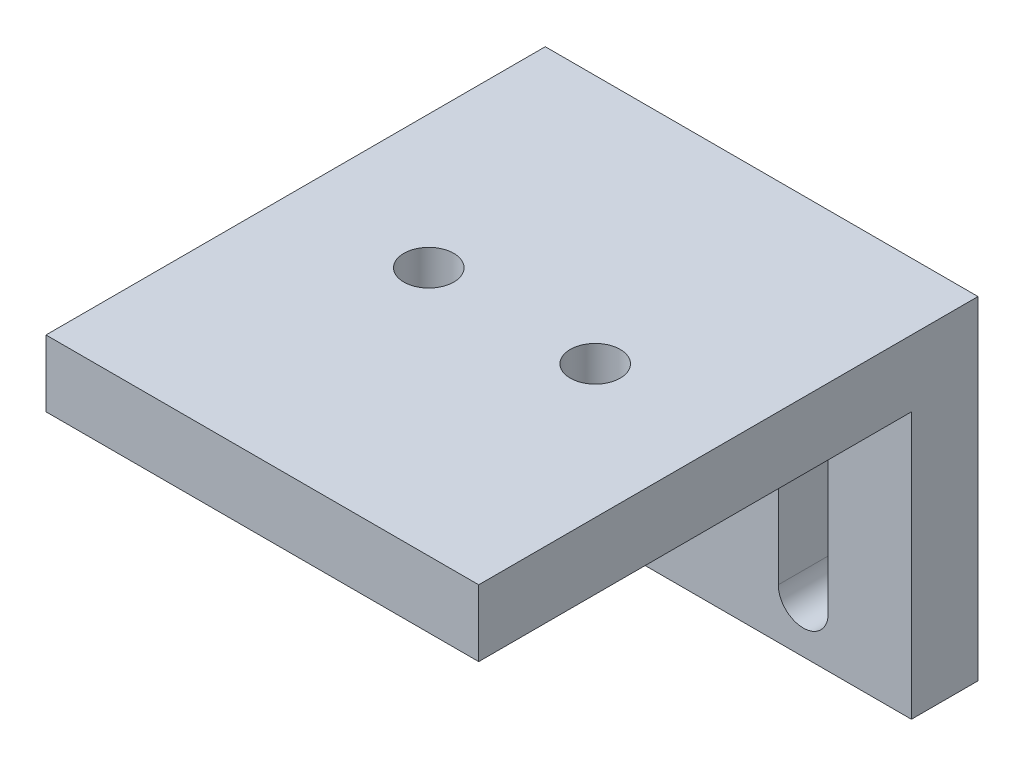
ISO-10303-21;
HEADER;
FILE_DESCRIPTION(('STEP AP214'),'2;1');
FILE_NAME('part.step','',(''),(''),'','','');
FILE_SCHEMA(('AUTOMOTIVE_DESIGN { 1 0 10303 214 1 1 1 1 }'));
ENDSEC;
DATA;
#1=APPLICATION_CONTEXT('core data for automotive mechanical design processes');
#2=APPLICATION_PROTOCOL_DEFINITION('international standard','automotive_design',2000,#1);
#3=PRODUCT_CONTEXT('',#1,'mechanical');
#4=PRODUCT('Part','Part','',(#3));
#5=PRODUCT_RELATED_PRODUCT_CATEGORY('part','',(#4));
#6=PRODUCT_DEFINITION_FORMATION('','',#4);
#7=PRODUCT_DEFINITION_CONTEXT('part definition',#1,'design');
#8=PRODUCT_DEFINITION('design','',#6,#7);
#9=PRODUCT_DEFINITION_SHAPE('','',#8);
#10=(LENGTH_UNIT() NAMED_UNIT(*) SI_UNIT(.MILLI.,.METRE.));
#11=(NAMED_UNIT(*) PLANE_ANGLE_UNIT() SI_UNIT($,.RADIAN.));
#12=(NAMED_UNIT(*) SI_UNIT($,.STERADIAN.) SOLID_ANGLE_UNIT());
#13=UNCERTAINTY_MEASURE_WITH_UNIT(LENGTH_MEASURE(1.E-05),#10,'distance_accuracy_value','');
#14=(GEOMETRIC_REPRESENTATION_CONTEXT(3) GLOBAL_UNCERTAINTY_ASSIGNED_CONTEXT((#13)) GLOBAL_UNIT_ASSIGNED_CONTEXT((#10,
#11,#12)) REPRESENTATION_CONTEXT('',''));
#15=CARTESIAN_POINT('',(0.,0.,0.));
#16=DIRECTION('',(0.,0.,1.));
#17=DIRECTION('',(1.,0.,0.));
#18=AXIS2_PLACEMENT_3D('',#15,#16,#17);
#19=CARTESIAN_POINT('',(-13.,20.,2.));
#20=DIRECTION('',(0.,0.,-1.));
#21=DIRECTION('',(-1.,0.,0.));
#22=AXIS2_PLACEMENT_3D('',#19,#20,#21);
#23=PLANE('',#22);
#24=DIRECTION('',(0.,1.,0.));
#25=VECTOR('',#24,1.);
#26=CARTESIAN_POINT('',(-5.,13.,2.));
#27=LINE('',#26,#25);
#28=CARTESIAN_POINT('',(-5.,3.,2.));
#29=VERTEX_POINT('',#28);
#30=CARTESIAN_POINT('',(-5.,13.,2.));
#31=VERTEX_POINT('',#30);
#32=EDGE_CURVE('E154',#29,#31,#27,.T.);
#33=ORIENTED_EDGE('',*,*,#32,.F.);
#34=CARTESIAN_POINT('',(-6.5,3.,2.));
#35=DIRECTION('',(0.,0.,1.));
#36=DIRECTION('',(-1.,0.,0.));
#37=AXIS2_PLACEMENT_3D('',#34,#35,#36);
#38=CIRCLE('',#37,1.5);
#39=CARTESIAN_POINT('',(-8.,3.,2.));
#40=VERTEX_POINT('',#39);
#41=EDGE_CURVE('E51',#40,#29,#38,.T.);
#42=ORIENTED_EDGE('',*,*,#41,.F.);
#43=DIRECTION('',(0.,-1.,0.));
#44=VECTOR('',#43,1.);
#45=CARTESIAN_POINT('',(-8.,13.,2.));
#46=LINE('',#45,#44);
#47=CARTESIAN_POINT('',(-8.,13.,2.));
#48=VERTEX_POINT('',#47);
#49=EDGE_CURVE('E160',#48,#40,#46,.T.);
#50=ORIENTED_EDGE('',*,*,#49,.F.);
#51=CARTESIAN_POINT('',(-6.5,13.,2.));
#52=DIRECTION('',(0.,0.,1.));
#53=DIRECTION('',(1.,0.,0.));
#54=AXIS2_PLACEMENT_3D('',#51,#52,#53);
#55=CIRCLE('',#54,1.5);
#56=EDGE_CURVE('E144',#31,#48,#55,.T.);
#57=ORIENTED_EDGE('',*,*,#56,.F.);
#58=EDGE_LOOP('',(#33,#42,#50,#57));
#59=FACE_BOUND('',#58,.T.);
#60=DIRECTION('',(0.,1.,0.));
#61=VECTOR('',#60,1.);
#62=CARTESIAN_POINT('',(7.99999999999999,13.,2.));
#63=LINE('',#62,#61);
#64=CARTESIAN_POINT('',(7.99999999999999,3.,2.));
#65=VERTEX_POINT('',#64);
#66=CARTESIAN_POINT('',(7.99999999999999,13.,2.));
#67=VERTEX_POINT('',#66);
#68=EDGE_CURVE('E171',#65,#67,#63,.T.);
#69=ORIENTED_EDGE('',*,*,#68,.F.);
#70=CARTESIAN_POINT('',(6.49999999999999,3.,2.));
#71=DIRECTION('',(0.,0.,1.));
#72=DIRECTION('',(1.,0.,0.));
#73=AXIS2_PLACEMENT_3D('',#70,#71,#72);
#74=CIRCLE('',#73,1.5);
#75=CARTESIAN_POINT('',(4.99999999999999,3.,2.));
#76=VERTEX_POINT('',#75);
#77=EDGE_CURVE('E59',#76,#65,#74,.T.);
#78=ORIENTED_EDGE('',*,*,#77,.F.);
#79=DIRECTION('',(0.,-1.,0.));
#80=VECTOR('',#79,1.);
#81=CARTESIAN_POINT('',(4.99999999999999,13.,2.));
#82=LINE('',#81,#80);
#83=CARTESIAN_POINT('',(4.99999999999999,13.,2.));
#84=VERTEX_POINT('',#83);
#85=EDGE_CURVE('E177',#84,#76,#82,.T.);
#86=ORIENTED_EDGE('',*,*,#85,.F.);
#87=CARTESIAN_POINT('',(6.49999999999999,13.,2.));
#88=DIRECTION('',(0.,0.,1.));
#89=DIRECTION('',(-1.,0.,0.));
#90=AXIS2_PLACEMENT_3D('',#87,#88,#89);
#91=CIRCLE('',#90,1.5);
#92=EDGE_CURVE('E174',#67,#84,#91,.T.);
#93=ORIENTED_EDGE('',*,*,#92,.F.);
#94=EDGE_LOOP('',(#69,#78,#86,#93));
#95=FACE_BOUND('',#94,.T.);
#96=DIRECTION('',(1.,0.,0.));
#97=VECTOR('',#96,1.);
#98=CARTESIAN_POINT('',(-13.,16.,2.));
#99=LINE('',#98,#97);
#100=CARTESIAN_POINT('',(-13.,16.,2.));
#101=VERTEX_POINT('',#100);
#102=CARTESIAN_POINT('',(13.,16.,2.));
#103=VERTEX_POINT('',#102);
#104=EDGE_CURVE('E198',#101,#103,#99,.T.);
#105=ORIENTED_EDGE('',*,*,#104,.F.);
#106=DIRECTION('',(0.,-1.,0.));
#107=VECTOR('',#106,1.);
#108=CARTESIAN_POINT('',(-13.,20.,2.));
#109=LINE('',#108,#107);
#110=CARTESIAN_POINT('',(-13.,0.,2.));
#111=VERTEX_POINT('',#110);
#112=EDGE_CURVE('E223',#101,#111,#109,.T.);
#113=ORIENTED_EDGE('',*,*,#112,.T.);
#114=DIRECTION('',(1.,0.,0.));
#115=VECTOR('',#114,1.);
#116=CARTESIAN_POINT('',(-13.,0.,2.));
#117=LINE('',#116,#115);
#118=CARTESIAN_POINT('',(13.,0.,2.));
#119=VERTEX_POINT('',#118);
#120=EDGE_CURVE('E215',#111,#119,#117,.T.);
#121=ORIENTED_EDGE('',*,*,#120,.T.);
#122=DIRECTION('',(0.,-1.,0.));
#123=VECTOR('',#122,1.);
#124=CARTESIAN_POINT('',(13.,20.,2.));
#125=LINE('',#124,#123);
#126=EDGE_CURVE('E239',#103,#119,#125,.T.);
#127=ORIENTED_EDGE('',*,*,#126,.F.);
#128=EDGE_LOOP('',(#105,#113,#121,#127));
#129=FACE_BOUND('',#128,.T.);
#130=ADVANCED_FACE('F37',(#59,#95,#129),#23,.F.);
#131=CARTESIAN_POINT('',(13.,20.,2.));
#132=DIRECTION('',(-1.,0.,0.));
#133=DIRECTION('',(0.,0.,1.));
#134=AXIS2_PLACEMENT_3D('',#131,#132,#133);
#135=PLANE('',#134);
#136=DIRECTION('',(0.,0.,-1.));
#137=VECTOR('',#136,1.);
#138=CARTESIAN_POINT('',(13.,0.,2.));
#139=LINE('',#138,#137);
#140=CARTESIAN_POINT('',(13.,0.,-2.));
#141=VERTEX_POINT('',#140);
#142=EDGE_CURVE('E226',#119,#141,#139,.T.);
#143=ORIENTED_EDGE('',*,*,#142,.T.);
#144=DIRECTION('',(0.,-1.,0.));
#145=VECTOR('',#144,1.);
#146=CARTESIAN_POINT('',(13.,20.,-2.));
#147=LINE('',#146,#145);
#148=CARTESIAN_POINT('',(13.,20.,-2.));
#149=VERTEX_POINT('',#148);
#150=EDGE_CURVE('E236',#149,#141,#147,.T.);
#151=ORIENTED_EDGE('',*,*,#150,.F.);
#152=DIRECTION('',(0.,0.,-1.));
#153=VECTOR('',#152,1.);
#154=CARTESIAN_POINT('',(13.,20.,2.));
#155=LINE('',#154,#153);
#156=CARTESIAN_POINT('',(13.,20.,28.));
#157=VERTEX_POINT('',#156);
#158=EDGE_CURVE('E216',#157,#149,#155,.T.);
#159=ORIENTED_EDGE('',*,*,#158,.F.);
#160=DIRECTION('',(0.,1.,0.));
#161=VECTOR('',#160,1.);
#162=CARTESIAN_POINT('',(13.,16.,28.));
#163=LINE('',#162,#161);
#164=CARTESIAN_POINT('',(13.,16.,28.));
#165=VERTEX_POINT('',#164);
#166=EDGE_CURVE('E197',#165,#157,#163,.T.);
#167=ORIENTED_EDGE('',*,*,#166,.F.);
#168=DIRECTION('',(0.,0.,-1.));
#169=VECTOR('',#168,1.);
#170=CARTESIAN_POINT('',(13.,16.,28.));
#171=LINE('',#170,#169);
#172=EDGE_CURVE('E212',#165,#103,#171,.T.);
#173=ORIENTED_EDGE('',*,*,#172,.T.);
#174=ORIENTED_EDGE('',*,*,#126,.T.);
#175=EDGE_LOOP('',(#143,#151,#159,#167,#173,#174));
#176=FACE_BOUND('',#175,.T.);
#177=ADVANCED_FACE('F281',(#176),#135,.F.);
#178=CARTESIAN_POINT('',(-13.,20.,-2.));
#179=DIRECTION('',(0.,0.,1.));
#180=DIRECTION('',(1.,0.,0.));
#181=AXIS2_PLACEMENT_3D('',#178,#179,#180);
#182=PLANE('',#181);
#183=DIRECTION('',(0.,-1.,0.));
#184=VECTOR('',#183,1.);
#185=CARTESIAN_POINT('',(-8.,20.,-2.));
#186=LINE('',#185,#184);
#187=CARTESIAN_POINT('',(-8.,13.,-2.));
#188=VERTEX_POINT('',#187);
#189=CARTESIAN_POINT('',(-8.,3.,-2.));
#190=VERTEX_POINT('',#189);
#191=EDGE_CURVE('E44',#188,#190,#186,.T.);
#192=ORIENTED_EDGE('',*,*,#191,.T.);
#193=CARTESIAN_POINT('',(-6.5,3.,-2.));
#194=DIRECTION('',(0.,0.,1.));
#195=DIRECTION('',(1.,0.,0.));
#196=AXIS2_PLACEMENT_3D('',#193,#194,#195);
#197=CIRCLE('',#196,1.5);
#198=CARTESIAN_POINT('',(-5.,3.,-2.));
#199=VERTEX_POINT('',#198);
#200=EDGE_CURVE('E11',#190,#199,#197,.T.);
#201=ORIENTED_EDGE('',*,*,#200,.T.);
#202=DIRECTION('',(0.,1.,0.));
#203=VECTOR('',#202,1.);
#204=CARTESIAN_POINT('',(-5.,20.,-2.));
#205=LINE('',#204,#203);
#206=CARTESIAN_POINT('',(-5.,13.,-2.));
#207=VERTEX_POINT('',#206);
#208=EDGE_CURVE('E257',#199,#207,#205,.T.);
#209=ORIENTED_EDGE('',*,*,#208,.T.);
#210=CARTESIAN_POINT('',(-6.5,13.,-2.));
#211=DIRECTION('',(0.,0.,1.));
#212=DIRECTION('',(1.,0.,0.));
#213=AXIS2_PLACEMENT_3D('',#210,#211,#212);
#214=CIRCLE('',#213,1.5);
#215=EDGE_CURVE('E147',#207,#188,#214,.T.);
#216=ORIENTED_EDGE('',*,*,#215,.T.);
#217=EDGE_LOOP('',(#192,#201,#209,#216));
#218=FACE_BOUND('',#217,.T.);
#219=DIRECTION('',(0.,-1.,0.));
#220=VECTOR('',#219,1.);
#221=CARTESIAN_POINT('',(5.,20.,-2.));
#222=LINE('',#221,#220);
#223=CARTESIAN_POINT('',(4.99999999999999,13.,-2.));
#224=VERTEX_POINT('',#223);
#225=CARTESIAN_POINT('',(4.99999999999999,3.,-2.));
#226=VERTEX_POINT('',#225);
#227=EDGE_CURVE('E251',#224,#226,#222,.T.);
#228=ORIENTED_EDGE('',*,*,#227,.T.);
#229=CARTESIAN_POINT('',(6.49999999999999,3.,-2.));
#230=DIRECTION('',(0.,0.,1.));
#231=DIRECTION('',(1.,0.,0.));
#232=AXIS2_PLACEMENT_3D('',#229,#230,#231);
#233=CIRCLE('',#232,1.5);
#234=CARTESIAN_POINT('',(7.99999999999999,3.,-2.));
#235=VERTEX_POINT('',#234);
#236=EDGE_CURVE('E254',#226,#235,#233,.T.);
#237=ORIENTED_EDGE('',*,*,#236,.T.);
#238=DIRECTION('',(0.,1.,0.));
#239=VECTOR('',#238,1.);
#240=CARTESIAN_POINT('',(7.99999999999999,20.,-2.));
#241=LINE('',#240,#239);
#242=CARTESIAN_POINT('',(7.99999999999999,13.,-2.));
#243=VERTEX_POINT('',#242);
#244=EDGE_CURVE('E241',#235,#243,#241,.T.);
#245=ORIENTED_EDGE('',*,*,#244,.T.);
#246=CARTESIAN_POINT('',(6.49999999999999,13.,-2.));
#247=DIRECTION('',(0.,0.,1.));
#248=DIRECTION('',(1.,0.,0.));
#249=AXIS2_PLACEMENT_3D('',#246,#247,#248);
#250=CIRCLE('',#249,1.5);
#251=EDGE_CURVE('E248',#243,#224,#250,.T.);
#252=ORIENTED_EDGE('',*,*,#251,.T.);
#253=EDGE_LOOP('',(#228,#237,#245,#252));
#254=FACE_BOUND('',#253,.T.);
#255=DIRECTION('',(-1.,0.,0.));
#256=VECTOR('',#255,1.);
#257=CARTESIAN_POINT('',(-13.,0.,-2.));
#258=LINE('',#257,#256);
#259=CARTESIAN_POINT('',(-13.,0.,-2.));
#260=VERTEX_POINT('',#259);
#261=EDGE_CURVE('E228',#141,#260,#258,.T.);
#262=ORIENTED_EDGE('',*,*,#261,.T.);
#263=DIRECTION('',(0.,-1.,0.));
#264=VECTOR('',#263,1.);
#265=CARTESIAN_POINT('',(-13.,20.,-2.));
#266=LINE('',#265,#264);
#267=CARTESIAN_POINT('',(-13.,20.,-2.));
#268=VERTEX_POINT('',#267);
#269=EDGE_CURVE('E233',#268,#260,#266,.T.);
#270=ORIENTED_EDGE('',*,*,#269,.F.);
#271=DIRECTION('',(-1.,0.,0.));
#272=VECTOR('',#271,1.);
#273=CARTESIAN_POINT('',(-13.,20.,-2.));
#274=LINE('',#273,#272);
#275=EDGE_CURVE('E218',#149,#268,#274,.T.);
#276=ORIENTED_EDGE('',*,*,#275,.F.);
#277=ORIENTED_EDGE('',*,*,#150,.T.);
#278=EDGE_LOOP('',(#262,#270,#276,#277));
#279=FACE_BOUND('',#278,.T.);
#280=ADVANCED_FACE('F261',(#218,#254,#279),#182,.F.);
#281=CARTESIAN_POINT('',(-13.,20.,2.));
#282=DIRECTION('',(1.,0.,0.));
#283=DIRECTION('',(0.,0.,-1.));
#284=AXIS2_PLACEMENT_3D('',#281,#282,#283);
#285=PLANE('',#284);
#286=DIRECTION('',(0.,0.,1.));
#287=VECTOR('',#286,1.);
#288=CARTESIAN_POINT('',(-13.,0.,2.));
#289=LINE('',#288,#287);
#290=EDGE_CURVE('E219',#260,#111,#289,.T.);
#291=ORIENTED_EDGE('',*,*,#290,.T.);
#292=ORIENTED_EDGE('',*,*,#112,.F.);
#293=DIRECTION('',(0.,0.,-1.));
#294=VECTOR('',#293,1.);
#295=CARTESIAN_POINT('',(-13.,16.,28.));
#296=LINE('',#295,#294);
#297=CARTESIAN_POINT('',(-13.,16.,28.));
#298=VERTEX_POINT('',#297);
#299=EDGE_CURVE('E206',#298,#101,#296,.T.);
#300=ORIENTED_EDGE('',*,*,#299,.F.);
#301=DIRECTION('',(0.,-1.,0.));
#302=VECTOR('',#301,1.);
#303=CARTESIAN_POINT('',(-13.,16.,28.));
#304=LINE('',#303,#302);
#305=CARTESIAN_POINT('',(-13.,20.,28.));
#306=VERTEX_POINT('',#305);
#307=EDGE_CURVE('E204',#306,#298,#304,.T.);
#308=ORIENTED_EDGE('',*,*,#307,.F.);
#309=DIRECTION('',(0.,0.,1.));
#310=VECTOR('',#309,1.);
#311=CARTESIAN_POINT('',(-13.,20.,2.));
#312=LINE('',#311,#310);
#313=EDGE_CURVE('E221',#268,#306,#312,.T.);
#314=ORIENTED_EDGE('',*,*,#313,.F.);
#315=ORIENTED_EDGE('',*,*,#269,.T.);
#316=EDGE_LOOP('',(#291,#292,#300,#308,#314,#315));
#317=FACE_BOUND('',#316,.T.);
#318=ADVANCED_FACE('F289',(#317),#285,.F.);
#319=CARTESIAN_POINT('',(0.,20.,0.));
#320=DIRECTION('',(0.,1.,0.));
#321=DIRECTION('',(0.,0.,1.));
#322=AXIS2_PLACEMENT_3D('',#319,#320,#321);
#323=PLANE('',#322);
#324=CARTESIAN_POINT('',(-5.,20.,13.));
#325=DIRECTION('',(0.,1.,0.));
#326=DIRECTION('',(0.,0.,1.));
#327=AXIS2_PLACEMENT_3D('',#324,#325,#326);
#328=CIRCLE('',#327,1.5);
#329=CARTESIAN_POINT('',(-5.,20.,14.5));
#330=VERTEX_POINT('',#329);
#331=EDGE_CURVE('E188',#330,#330,#328,.T.);
#332=ORIENTED_EDGE('',*,*,#331,.F.);
#333=EDGE_LOOP('',(#332));
#334=FACE_BOUND('',#333,.T.);
#335=CARTESIAN_POINT('',(5.,20.,13.));
#336=DIRECTION('',(0.,1.,0.));
#337=DIRECTION('',(0.,0.,1.));
#338=AXIS2_PLACEMENT_3D('',#335,#336,#337);
#339=CIRCLE('',#338,1.5);
#340=CARTESIAN_POINT('',(5.,20.,14.5));
#341=VERTEX_POINT('',#340);
#342=EDGE_CURVE('E167',#341,#341,#339,.T.);
#343=ORIENTED_EDGE('',*,*,#342,.F.);
#344=EDGE_LOOP('',(#343));
#345=FACE_BOUND('',#344,.T.);
#346=ORIENTED_EDGE('',*,*,#313,.T.);
#347=DIRECTION('',(-1.,0.,0.));
#348=VECTOR('',#347,1.);
#349=CARTESIAN_POINT('',(-13.,20.,28.));
#350=LINE('',#349,#348);
#351=EDGE_CURVE('E201',#157,#306,#350,.T.);
#352=ORIENTED_EDGE('',*,*,#351,.F.);
#353=ORIENTED_EDGE('',*,*,#158,.T.);
#354=ORIENTED_EDGE('',*,*,#275,.T.);
#355=EDGE_LOOP('',(#346,#352,#353,#354));
#356=FACE_BOUND('',#355,.T.);
#357=ADVANCED_FACE('F294',(#334,#345,#356),#323,.T.);
#358=CARTESIAN_POINT('',(0.,0.,0.));
#359=DIRECTION('',(0.,1.,0.));
#360=DIRECTION('',(0.,0.,1.));
#361=AXIS2_PLACEMENT_3D('',#358,#359,#360);
#362=PLANE('',#361);
#363=ORIENTED_EDGE('',*,*,#120,.F.);
#364=ORIENTED_EDGE('',*,*,#290,.F.);
#365=ORIENTED_EDGE('',*,*,#261,.F.);
#366=ORIENTED_EDGE('',*,*,#142,.F.);
#367=EDGE_LOOP('',(#363,#364,#365,#366));
#368=FACE_BOUND('',#367,.T.);
#369=ADVANCED_FACE('F296',(#368),#362,.F.);
#370=CARTESIAN_POINT('',(-13.,16.,28.));
#371=DIRECTION('',(0.,1.,0.));
#372=DIRECTION('',(-1.,0.,0.));
#373=AXIS2_PLACEMENT_3D('',#370,#371,#372);
#374=PLANE('',#373);
#375=CARTESIAN_POINT('',(-5.,16.,13.));
#376=DIRECTION('',(0.,1.,0.));
#377=DIRECTION('',(-1.,0.,0.));
#378=AXIS2_PLACEMENT_3D('',#375,#376,#377);
#379=CIRCLE('',#378,1.5);
#380=CARTESIAN_POINT('',(-6.5,16.,13.));
#381=VERTEX_POINT('',#380);
#382=EDGE_CURVE('E209',#381,#381,#379,.T.);
#383=ORIENTED_EDGE('',*,*,#382,.T.);
#384=EDGE_LOOP('',(#383));
#385=FACE_BOUND('',#384,.T.);
#386=CARTESIAN_POINT('',(5.,16.,13.));
#387=DIRECTION('',(0.,1.,0.));
#388=DIRECTION('',(-1.,0.,0.));
#389=AXIS2_PLACEMENT_3D('',#386,#387,#388);
#390=CIRCLE('',#389,1.5);
#391=CARTESIAN_POINT('',(3.5,16.,13.));
#392=VERTEX_POINT('',#391);
#393=EDGE_CURVE('E191',#392,#392,#390,.T.);
#394=ORIENTED_EDGE('',*,*,#393,.T.);
#395=EDGE_LOOP('',(#394));
#396=FACE_BOUND('',#395,.T.);
#397=ORIENTED_EDGE('',*,*,#104,.T.);
#398=ORIENTED_EDGE('',*,*,#172,.F.);
#399=DIRECTION('',(1.,0.,0.));
#400=VECTOR('',#399,1.);
#401=CARTESIAN_POINT('',(-13.,16.,28.));
#402=LINE('',#401,#400);
#403=EDGE_CURVE('E194',#298,#165,#402,.T.);
#404=ORIENTED_EDGE('',*,*,#403,.F.);
#405=ORIENTED_EDGE('',*,*,#299,.T.);
#406=EDGE_LOOP('',(#397,#398,#404,#405));
#407=FACE_BOUND('',#406,.T.);
#408=ADVANCED_FACE('F299',(#385,#396,#407),#374,.F.);
#409=CARTESIAN_POINT('',(0.,0.,28.));
#410=DIRECTION('',(0.,0.,1.));
#411=DIRECTION('',(1.,0.,0.));
#412=AXIS2_PLACEMENT_3D('',#409,#410,#411);
#413=PLANE('',#412);
#414=ORIENTED_EDGE('',*,*,#403,.T.);
#415=ORIENTED_EDGE('',*,*,#166,.T.);
#416=ORIENTED_EDGE('',*,*,#351,.T.);
#417=ORIENTED_EDGE('',*,*,#307,.T.);
#418=EDGE_LOOP('',(#414,#415,#416,#417));
#419=FACE_BOUND('',#418,.T.);
#420=ADVANCED_FACE('F306',(#419),#413,.T.);
#421=CARTESIAN_POINT('',(5.,-5.,13.));
#422=DIRECTION('',(0.,1.,0.));
#423=DIRECTION('',(0.,0.,1.));
#424=AXIS2_PLACEMENT_3D('',#421,#422,#423);
#425=CYLINDRICAL_SURFACE('',#424,1.5);
#426=ORIENTED_EDGE('',*,*,#342,.T.);
#427=EDGE_LOOP('',(#426));
#428=FACE_BOUND('',#427,.T.);
#429=ORIENTED_EDGE('',*,*,#393,.F.);
#430=EDGE_LOOP('',(#429));
#431=FACE_BOUND('',#430,.T.);
#432=ADVANCED_FACE('F310',(#428,#431),#425,.F.);
#433=CARTESIAN_POINT('',(-5.,-5.,13.));
#434=DIRECTION('',(0.,1.,0.));
#435=DIRECTION('',(0.,0.,1.));
#436=AXIS2_PLACEMENT_3D('',#433,#434,#435);
#437=CYLINDRICAL_SURFACE('',#436,1.5);
#438=ORIENTED_EDGE('',*,*,#331,.T.);
#439=EDGE_LOOP('',(#438));
#440=FACE_BOUND('',#439,.T.);
#441=ORIENTED_EDGE('',*,*,#382,.F.);
#442=EDGE_LOOP('',(#441));
#443=FACE_BOUND('',#442,.T.);
#444=ADVANCED_FACE('F314',(#440,#443),#437,.F.);
#445=CARTESIAN_POINT('',(6.49999999999999,3.,-23.));
#446=DIRECTION('',(0.,0.,1.));
#447=DIRECTION('',(1.,0.,0.));
#448=AXIS2_PLACEMENT_3D('',#445,#446,#447);
#449=CYLINDRICAL_SURFACE('',#448,1.5);
#450=DIRECTION('',(0.,0.,1.));
#451=VECTOR('',#450,1.);
#452=CARTESIAN_POINT('',(4.99999999999999,3.,-23.));
#453=LINE('',#452,#451);
#454=EDGE_CURVE('E181',#226,#76,#453,.T.);
#455=ORIENTED_EDGE('',*,*,#454,.T.);
#456=ORIENTED_EDGE('',*,*,#77,.T.);
#457=DIRECTION('',(0.,0.,1.));
#458=VECTOR('',#457,1.);
#459=CARTESIAN_POINT('',(7.99999999999999,3.,-23.));
#460=LINE('',#459,#458);
#461=EDGE_CURVE('E180',#235,#65,#460,.T.);
#462=ORIENTED_EDGE('',*,*,#461,.F.);
#463=ORIENTED_EDGE('',*,*,#236,.F.);
#464=EDGE_LOOP('',(#455,#456,#462,#463));
#465=FACE_BOUND('',#464,.T.);
#466=ADVANCED_FACE('F318',(#465),#449,.F.);
#467=CARTESIAN_POINT('',(4.99999999999999,13.,-23.));
#468=DIRECTION('',(-1.,0.,0.));
#469=DIRECTION('',(0.,0.,1.));
#470=AXIS2_PLACEMENT_3D('',#467,#468,#469);
#471=PLANE('',#470);
#472=DIRECTION('',(0.,0.,1.));
#473=VECTOR('',#472,1.);
#474=CARTESIAN_POINT('',(4.99999999999999,13.,-23.));
#475=LINE('',#474,#473);
#476=EDGE_CURVE('E183',#224,#84,#475,.T.);
#477=ORIENTED_EDGE('',*,*,#476,.T.);
#478=ORIENTED_EDGE('',*,*,#85,.T.);
#479=ORIENTED_EDGE('',*,*,#454,.F.);
#480=ORIENTED_EDGE('',*,*,#227,.F.);
#481=EDGE_LOOP('',(#477,#478,#479,#480));
#482=FACE_BOUND('',#481,.T.);
#483=ADVANCED_FACE('F321',(#482),#471,.F.);
#484=CARTESIAN_POINT('',(6.49999999999999,13.,-23.));
#485=DIRECTION('',(0.,0.,1.));
#486=DIRECTION('',(1.,0.,0.));
#487=AXIS2_PLACEMENT_3D('',#484,#485,#486);
#488=CYLINDRICAL_SURFACE('',#487,1.5);
#489=DIRECTION('',(0.,0.,1.));
#490=VECTOR('',#489,1.);
#491=CARTESIAN_POINT('',(7.99999999999999,13.,-23.));
#492=LINE('',#491,#490);
#493=EDGE_CURVE('E185',#243,#67,#492,.T.);
#494=ORIENTED_EDGE('',*,*,#493,.T.);
#495=ORIENTED_EDGE('',*,*,#92,.T.);
#496=ORIENTED_EDGE('',*,*,#476,.F.);
#497=ORIENTED_EDGE('',*,*,#251,.F.);
#498=EDGE_LOOP('',(#494,#495,#496,#497));
#499=FACE_BOUND('',#498,.T.);
#500=ADVANCED_FACE('F275',(#499),#488,.F.);
#501=CARTESIAN_POINT('',(7.99999999999999,13.,-23.));
#502=DIRECTION('',(1.,0.,0.));
#503=DIRECTION('',(0.,0.,-1.));
#504=AXIS2_PLACEMENT_3D('',#501,#502,#503);
#505=PLANE('',#504);
#506=ORIENTED_EDGE('',*,*,#461,.T.);
#507=ORIENTED_EDGE('',*,*,#68,.T.);
#508=ORIENTED_EDGE('',*,*,#493,.F.);
#509=ORIENTED_EDGE('',*,*,#244,.F.);
#510=EDGE_LOOP('',(#506,#507,#508,#509));
#511=FACE_BOUND('',#510,.T.);
#512=ADVANCED_FACE('F268',(#511),#505,.F.);
#513=CARTESIAN_POINT('',(-6.5,3.,-23.));
#514=DIRECTION('',(0.,0.,1.));
#515=DIRECTION('',(1.,0.,0.));
#516=AXIS2_PLACEMENT_3D('',#513,#514,#515);
#517=CYLINDRICAL_SURFACE('',#516,1.5);
#518=DIRECTION('',(0.,0.,1.));
#519=VECTOR('',#518,1.);
#520=CARTESIAN_POINT('',(-8.,3.,-23.));
#521=LINE('',#520,#519);
#522=EDGE_CURVE('E165',#190,#40,#521,.T.);
#523=ORIENTED_EDGE('',*,*,#522,.T.);
#524=ORIENTED_EDGE('',*,*,#41,.T.);
#525=DIRECTION('',(0.,0.,1.));
#526=VECTOR('',#525,1.);
#527=CARTESIAN_POINT('',(-5.,3.,-23.));
#528=LINE('',#527,#526);
#529=EDGE_CURVE('E151',#199,#29,#528,.T.);
#530=ORIENTED_EDGE('',*,*,#529,.F.);
#531=ORIENTED_EDGE('',*,*,#200,.F.);
#532=EDGE_LOOP('',(#523,#524,#530,#531));
#533=FACE_BOUND('',#532,.T.);
#534=ADVANCED_FACE('F266',(#533),#517,.F.);
#535=CARTESIAN_POINT('',(-8.,13.,-23.));
#536=DIRECTION('',(-1.,0.,0.));
#537=DIRECTION('',(0.,0.,1.));
#538=AXIS2_PLACEMENT_3D('',#535,#536,#537);
#539=PLANE('',#538);
#540=DIRECTION('',(0.,0.,1.));
#541=VECTOR('',#540,1.);
#542=CARTESIAN_POINT('',(-8.,13.,-23.));
#543=LINE('',#542,#541);
#544=EDGE_CURVE('E150',#188,#48,#543,.T.);
#545=ORIENTED_EDGE('',*,*,#544,.T.);
#546=ORIENTED_EDGE('',*,*,#49,.T.);
#547=ORIENTED_EDGE('',*,*,#522,.F.);
#548=ORIENTED_EDGE('',*,*,#191,.F.);
#549=EDGE_LOOP('',(#545,#546,#547,#548));
#550=FACE_BOUND('',#549,.T.);
#551=ADVANCED_FACE('F265',(#550),#539,.F.);
#552=CARTESIAN_POINT('',(-6.5,13.,-23.));
#553=DIRECTION('',(0.,0.,1.));
#554=DIRECTION('',(1.,0.,0.));
#555=AXIS2_PLACEMENT_3D('',#552,#553,#554);
#556=CYLINDRICAL_SURFACE('',#555,1.5);
#557=DIRECTION('',(0.,0.,1.));
#558=VECTOR('',#557,1.);
#559=CARTESIAN_POINT('',(-5.,13.,-23.));
#560=LINE('',#559,#558);
#561=EDGE_CURVE('E139',#207,#31,#560,.T.);
#562=ORIENTED_EDGE('',*,*,#561,.T.);
#563=ORIENTED_EDGE('',*,*,#56,.T.);
#564=ORIENTED_EDGE('',*,*,#544,.F.);
#565=ORIENTED_EDGE('',*,*,#215,.F.);
#566=EDGE_LOOP('',(#562,#563,#564,#565));
#567=FACE_BOUND('',#566,.T.);
#568=ADVANCED_FACE('F141',(#567),#556,.F.);
#569=CARTESIAN_POINT('',(-5.,13.,-23.));
#570=DIRECTION('',(1.,0.,0.));
#571=DIRECTION('',(0.,0.,-1.));
#572=AXIS2_PLACEMENT_3D('',#569,#570,#571);
#573=PLANE('',#572);
#574=ORIENTED_EDGE('',*,*,#529,.T.);
#575=ORIENTED_EDGE('',*,*,#32,.T.);
#576=ORIENTED_EDGE('',*,*,#561,.F.);
#577=ORIENTED_EDGE('',*,*,#208,.F.);
#578=EDGE_LOOP('',(#574,#575,#576,#577));
#579=FACE_BOUND('',#578,.T.);
#580=ADVANCED_FACE('F155',(#579),#573,.F.);
#581=CLOSED_SHELL('',(#130,#177,#280,#318,#357,#369,#408,#420,#432,#444,#466,#483,#500,#512,
#534,#551,#568,#580));
#582=MANIFOLD_SOLID_BREP('B2',#581);
#583=ADVANCED_BREP_SHAPE_REPRESENTATION('',(#18,#582),#14);
#584=SHAPE_DEFINITION_REPRESENTATION(#9,#583);
ENDSEC;
END-ISO-10303-21;
